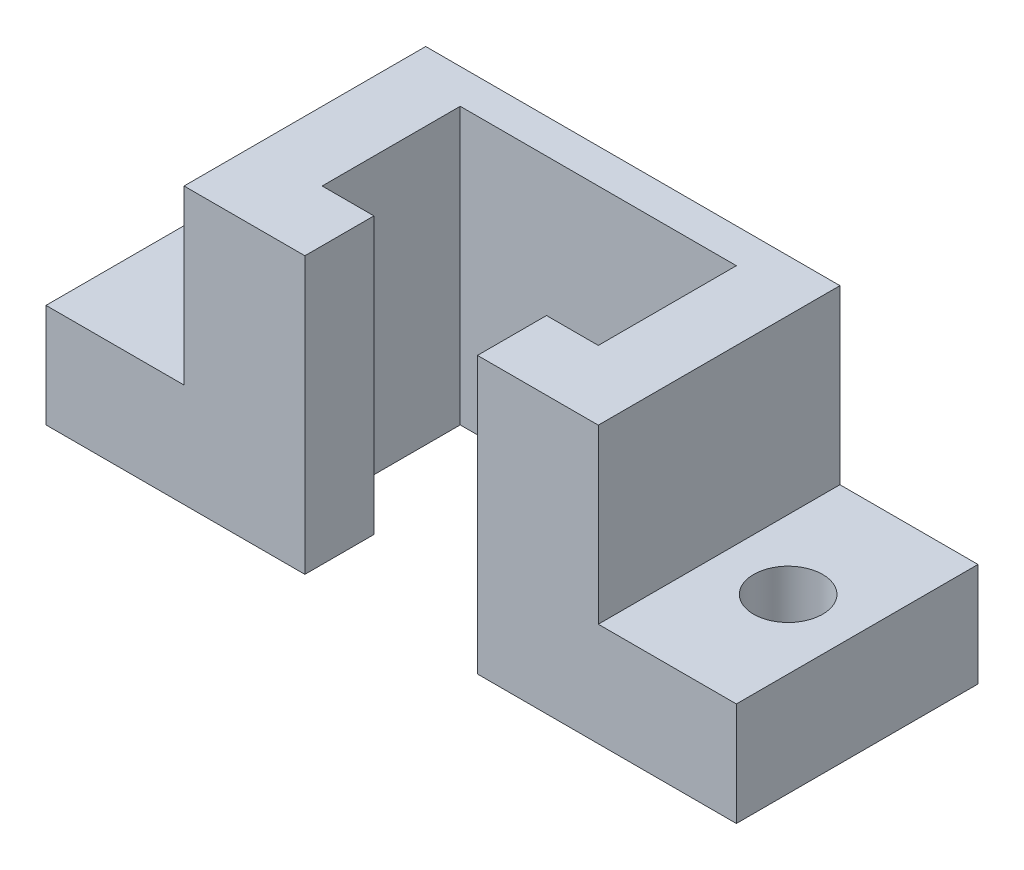
ISO-10303-21;
HEADER;
FILE_DESCRIPTION(('STEP AP214'),'2;1');
FILE_NAME('part.step','',(''),(''),'','','');
FILE_SCHEMA(('AUTOMOTIVE_DESIGN { 1 0 10303 214 1 1 1 1 }'));
ENDSEC;
DATA;
#1=APPLICATION_CONTEXT('core data for automotive mechanical design processes');
#2=APPLICATION_PROTOCOL_DEFINITION('international standard','automotive_design',2000,#1);
#3=PRODUCT_CONTEXT('',#1,'mechanical');
#4=PRODUCT('Part','Part','',(#3));
#5=PRODUCT_RELATED_PRODUCT_CATEGORY('part','',(#4));
#6=PRODUCT_DEFINITION_FORMATION('','',#4);
#7=PRODUCT_DEFINITION_CONTEXT('part definition',#1,'design');
#8=PRODUCT_DEFINITION('design','',#6,#7);
#9=PRODUCT_DEFINITION_SHAPE('','',#8);
#10=(LENGTH_UNIT() NAMED_UNIT(*) SI_UNIT(.MILLI.,.METRE.));
#11=(NAMED_UNIT(*) PLANE_ANGLE_UNIT() SI_UNIT($,.RADIAN.));
#12=(NAMED_UNIT(*) SI_UNIT($,.STERADIAN.) SOLID_ANGLE_UNIT());
#13=UNCERTAINTY_MEASURE_WITH_UNIT(LENGTH_MEASURE(1.E-05),#10,'distance_accuracy_value','');
#14=(GEOMETRIC_REPRESENTATION_CONTEXT(3) GLOBAL_UNCERTAINTY_ASSIGNED_CONTEXT((#13)) GLOBAL_UNIT_ASSIGNED_CONTEXT((#10,
#11,#12)) REPRESENTATION_CONTEXT('',''));
#15=CARTESIAN_POINT('',(0.,0.,0.));
#16=DIRECTION('',(0.,0.,1.));
#17=DIRECTION('',(1.,0.,0.));
#18=AXIS2_PLACEMENT_3D('',#15,#16,#17);
#19=CARTESIAN_POINT('',(0.,0.,35.));
#20=DIRECTION('',(0.,0.,-1.));
#21=DIRECTION('',(-1.,0.,0.));
#22=AXIS2_PLACEMENT_3D('',#19,#20,#21);
#23=PLANE('',#22);
#24=DIRECTION('',(0.,1.,0.));
#25=VECTOR('',#24,1.);
#26=CARTESIAN_POINT('',(30.,-20.,35.));
#27=LINE('',#26,#25);
#28=CARTESIAN_POINT('',(30.,-5.,35.));
#29=VERTEX_POINT('',#28);
#30=CARTESIAN_POINT('',(30.,19.9738533773121,35.));
#31=VERTEX_POINT('',#30);
#32=EDGE_CURVE('E168',#29,#31,#27,.T.);
#33=ORIENTED_EDGE('',*,*,#32,.T.);
#34=DIRECTION('',(1.,0.,0.));
#35=VECTOR('',#34,1.);
#36=CARTESIAN_POINT('',(30.,19.9738533773121,35.));
#37=LINE('',#36,#35);
#38=CARTESIAN_POINT('',(12.5,19.9738533773121,35.));
#39=VERTEX_POINT('',#38);
#40=EDGE_CURVE('E161',#39,#31,#37,.T.);
#41=ORIENTED_EDGE('',*,*,#40,.F.);
#42=DIRECTION('',(0.,1.,0.));
#43=VECTOR('',#42,1.);
#44=CARTESIAN_POINT('',(12.5,-60.,35.));
#45=LINE('',#44,#43);
#46=CARTESIAN_POINT('',(12.5,-20.,35.));
#47=VERTEX_POINT('',#46);
#48=EDGE_CURVE('E237',#47,#39,#45,.T.);
#49=ORIENTED_EDGE('',*,*,#48,.F.);
#50=DIRECTION('',(1.,0.,0.));
#51=VECTOR('',#50,1.);
#52=CARTESIAN_POINT('',(-30.,-20.,35.));
#53=LINE('',#52,#51);
#54=CARTESIAN_POINT('',(50.,-20.,35.));
#55=VERTEX_POINT('',#54);
#56=EDGE_CURVE('E167',#47,#55,#53,.T.);
#57=ORIENTED_EDGE('',*,*,#56,.T.);
#58=DIRECTION('',(0.,-1.,0.));
#59=VECTOR('',#58,1.);
#60=CARTESIAN_POINT('',(50.,-20.,35.));
#61=LINE('',#60,#59);
#62=CARTESIAN_POINT('',(50.,-5.,35.));
#63=VERTEX_POINT('',#62);
#64=EDGE_CURVE('E225',#63,#55,#61,.T.);
#65=ORIENTED_EDGE('',*,*,#64,.F.);
#66=DIRECTION('',(-1.,0.,0.));
#67=VECTOR('',#66,1.);
#68=CARTESIAN_POINT('',(50.,-5.,35.));
#69=LINE('',#68,#67);
#70=EDGE_CURVE('E234',#63,#29,#69,.T.);
#71=ORIENTED_EDGE('',*,*,#70,.T.);
#72=EDGE_LOOP('',(#33,#41,#49,#57,#65,#71));
#73=FACE_BOUND('',#72,.T.);
#74=ADVANCED_FACE('F36',(#73),#23,.F.);
#75=CARTESIAN_POINT('',(-30.,-20.,35.));
#76=DIRECTION('',(1.,0.,0.));
#77=DIRECTION('',(0.,0.,-1.));
#78=AXIS2_PLACEMENT_3D('',#75,#76,#77);
#79=PLANE('',#78);
#80=DIRECTION('',(0.,-1.,0.));
#81=VECTOR('',#80,1.);
#82=CARTESIAN_POINT('',(-30.,-20.,35.));
#83=LINE('',#82,#81);
#84=CARTESIAN_POINT('',(-30.,19.9738533773121,35.));
#85=VERTEX_POINT('',#84);
#86=CARTESIAN_POINT('',(-30.,-5.,35.));
#87=VERTEX_POINT('',#86);
#88=EDGE_CURVE('E40',#85,#87,#83,.T.);
#89=ORIENTED_EDGE('',*,*,#88,.F.);
#90=DIRECTION('',(0.,0.,1.));
#91=VECTOR('',#90,1.);
#92=CARTESIAN_POINT('',(-30.,19.9738533773121,-5.00000000014378E-05));
#93=LINE('',#92,#91);
#94=CARTESIAN_POINT('',(-30.,19.9738533773121,0.));
#95=VERTEX_POINT('',#94);
#96=EDGE_CURVE('E149',#95,#85,#93,.T.);
#97=ORIENTED_EDGE('',*,*,#96,.F.);
#98=DIRECTION('',(0.,-1.,0.));
#99=VECTOR('',#98,1.);
#100=CARTESIAN_POINT('',(-30.,-20.,0.));
#101=LINE('',#100,#99);
#102=CARTESIAN_POINT('',(-30.,-5.,0.));
#103=VERTEX_POINT('',#102);
#104=EDGE_CURVE('E177',#95,#103,#101,.T.);
#105=ORIENTED_EDGE('',*,*,#104,.T.);
#106=DIRECTION('',(0.,0.,-1.));
#107=VECTOR('',#106,1.);
#108=CARTESIAN_POINT('',(-30.,-5.,0.));
#109=LINE('',#108,#107);
#110=EDGE_CURVE('E165',#87,#103,#109,.T.);
#111=ORIENTED_EDGE('',*,*,#110,.F.);
#112=EDGE_LOOP('',(#89,#97,#105,#111));
#113=FACE_BOUND('',#112,.T.);
#114=ADVANCED_FACE('F163',(#113),#79,.F.);
#115=CARTESIAN_POINT('',(30.,-20.,35.));
#116=DIRECTION('',(-1.,0.,0.));
#117=DIRECTION('',(0.,0.,1.));
#118=AXIS2_PLACEMENT_3D('',#115,#116,#117);
#119=PLANE('',#118);
#120=DIRECTION('',(0.,1.,0.));
#121=VECTOR('',#120,1.);
#122=CARTESIAN_POINT('',(30.,-20.,0.));
#123=LINE('',#122,#121);
#124=CARTESIAN_POINT('',(30.,-5.,0.));
#125=VERTEX_POINT('',#124);
#126=CARTESIAN_POINT('',(30.,19.9738533773121,0.));
#127=VERTEX_POINT('',#126);
#128=EDGE_CURVE('E182',#125,#127,#123,.T.);
#129=ORIENTED_EDGE('',*,*,#128,.T.);
#130=DIRECTION('',(0.,0.,1.));
#131=VECTOR('',#130,1.);
#132=CARTESIAN_POINT('',(30.,19.9738533773121,-5.00000000014378E-05));
#133=LINE('',#132,#131);
#134=EDGE_CURVE('E155',#127,#31,#133,.T.);
#135=ORIENTED_EDGE('',*,*,#134,.T.);
#136=ORIENTED_EDGE('',*,*,#32,.F.);
#137=DIRECTION('',(0.,0.,1.));
#138=VECTOR('',#137,1.);
#139=CARTESIAN_POINT('',(30.,-5.,35.));
#140=LINE('',#139,#138);
#141=EDGE_CURVE('E185',#125,#29,#140,.T.);
#142=ORIENTED_EDGE('',*,*,#141,.F.);
#143=EDGE_LOOP('',(#129,#135,#136,#142));
#144=FACE_BOUND('',#143,.T.);
#145=ADVANCED_FACE('F38',(#144),#119,.F.);
#146=CARTESIAN_POINT('',(-20.,-60.,25.));
#147=DIRECTION('',(0.,0.,1.));
#148=DIRECTION('',(1.,0.,0.));
#149=AXIS2_PLACEMENT_3D('',#146,#147,#148);
#150=PLANE('',#149);
#151=DIRECTION('',(0.,1.,0.));
#152=VECTOR('',#151,1.);
#153=CARTESIAN_POINT('',(-20.,-60.,25.));
#154=LINE('',#153,#152);
#155=CARTESIAN_POINT('',(-20.,-20.,25.));
#156=VERTEX_POINT('',#155);
#157=CARTESIAN_POINT('',(-20.,19.9738533773121,25.));
#158=VERTEX_POINT('',#157);
#159=EDGE_CURVE('E251',#156,#158,#154,.T.);
#160=ORIENTED_EDGE('',*,*,#159,.T.);
#161=DIRECTION('',(1.,0.,0.));
#162=VECTOR('',#161,1.);
#163=CARTESIAN_POINT('',(-20.,19.9738533773121,25.));
#164=LINE('',#163,#162);
#165=CARTESIAN_POINT('',(-12.5,19.9738533773121,25.));
#166=VERTEX_POINT('',#165);
#167=EDGE_CURVE('E292',#158,#166,#164,.T.);
#168=ORIENTED_EDGE('',*,*,#167,.T.);
#169=DIRECTION('',(0.,-1.,0.));
#170=VECTOR('',#169,1.);
#171=CARTESIAN_POINT('',(-12.5,-60.,25.));
#172=LINE('',#171,#170);
#173=CARTESIAN_POINT('',(-12.5,-20.,25.));
#174=VERTEX_POINT('',#173);
#175=EDGE_CURVE('E46',#166,#174,#172,.T.);
#176=ORIENTED_EDGE('',*,*,#175,.T.);
#177=DIRECTION('',(1.,0.,0.));
#178=VECTOR('',#177,1.);
#179=CARTESIAN_POINT('',(-30.,-20.,25.));
#180=LINE('',#179,#178);
#181=EDGE_CURVE('E280',#156,#174,#180,.T.);
#182=ORIENTED_EDGE('',*,*,#181,.F.);
#183=EDGE_LOOP('',(#160,#168,#176,#182));
#184=FACE_BOUND('',#183,.T.);
#185=ADVANCED_FACE('F290',(#184),#150,.F.);
#186=CARTESIAN_POINT('',(-30.,-20.,35.));
#187=DIRECTION('',(0.,1.,0.));
#188=DIRECTION('',(0.,0.,1.));
#189=AXIS2_PLACEMENT_3D('',#186,#187,#188);
#190=PLANE('',#189);
#191=CARTESIAN_POINT('',(40.,-20.,17.5));
#192=DIRECTION('',(0.,-1.,0.));
#193=DIRECTION('',(0.,0.,-1.));
#194=AXIS2_PLACEMENT_3D('',#191,#192,#193);
#195=CIRCLE('',#194,5.);
#196=CARTESIAN_POINT('',(40.,-20.,12.5));
#197=VERTEX_POINT('',#196);
#198=EDGE_CURVE('E205',#197,#197,#195,.T.);
#199=ORIENTED_EDGE('',*,*,#198,.F.);
#200=EDGE_LOOP('',(#199));
#201=FACE_BOUND('',#200,.T.);
#202=CARTESIAN_POINT('',(-40.,-20.,17.5));
#203=DIRECTION('',(0.,-1.,0.));
#204=DIRECTION('',(0.,0.,-1.));
#205=AXIS2_PLACEMENT_3D('',#202,#203,#204);
#206=CIRCLE('',#205,5.);
#207=CARTESIAN_POINT('',(-40.,-20.,12.5));
#208=VERTEX_POINT('',#207);
#209=EDGE_CURVE('E310',#208,#208,#206,.T.);
#210=ORIENTED_EDGE('',*,*,#209,.F.);
#211=EDGE_LOOP('',(#210));
#212=FACE_BOUND('',#211,.T.);
#213=ORIENTED_EDGE('',*,*,#181,.T.);
#214=DIRECTION('',(0.,0.,1.));
#215=VECTOR('',#214,1.);
#216=CARTESIAN_POINT('',(-12.5,-20.,35.));
#217=LINE('',#216,#215);
#218=CARTESIAN_POINT('',(-12.5,-20.,35.));
#219=VERTEX_POINT('',#218);
#220=EDGE_CURVE('E245',#174,#219,#217,.T.);
#221=ORIENTED_EDGE('',*,*,#220,.T.);
#222=CARTESIAN_POINT('',(-50.,-20.,35.));
#223=VERTEX_POINT('',#222);
#224=EDGE_CURVE('E169',#223,#219,#53,.T.);
#225=ORIENTED_EDGE('',*,*,#224,.F.);
#226=DIRECTION('',(0.,0.,1.));
#227=VECTOR('',#226,1.);
#228=CARTESIAN_POINT('',(-50.,-20.,0.));
#229=LINE('',#228,#227);
#230=CARTESIAN_POINT('',(-50.,-20.,0.));
#231=VERTEX_POINT('',#230);
#232=EDGE_CURVE('E317',#231,#223,#229,.T.);
#233=ORIENTED_EDGE('',*,*,#232,.F.);
#234=DIRECTION('',(1.,0.,0.));
#235=VECTOR('',#234,1.);
#236=CARTESIAN_POINT('',(-30.,-20.,0.));
#237=LINE('',#236,#235);
#238=CARTESIAN_POINT('',(50.,-20.,0.));
#239=VERTEX_POINT('',#238);
#240=EDGE_CURVE('E172',#231,#239,#237,.T.);
#241=ORIENTED_EDGE('',*,*,#240,.T.);
#242=DIRECTION('',(0.,0.,-1.));
#243=VECTOR('',#242,1.);
#244=CARTESIAN_POINT('',(50.,-20.,35.));
#245=LINE('',#244,#243);
#246=EDGE_CURVE('E228',#55,#239,#245,.T.);
#247=ORIENTED_EDGE('',*,*,#246,.F.);
#248=ORIENTED_EDGE('',*,*,#56,.F.);
#249=DIRECTION('',(0.,0.,-1.));
#250=VECTOR('',#249,1.);
#251=CARTESIAN_POINT('',(12.5,-20.,35.));
#252=LINE('',#251,#250);
#253=CARTESIAN_POINT('',(12.5,-20.,25.));
#254=VERTEX_POINT('',#253);
#255=EDGE_CURVE('E240',#47,#254,#252,.T.);
#256=ORIENTED_EDGE('',*,*,#255,.T.);
#257=CARTESIAN_POINT('',(20.,-20.,25.));
#258=VERTEX_POINT('',#257);
#259=EDGE_CURVE('E278',#254,#258,#180,.T.);
#260=ORIENTED_EDGE('',*,*,#259,.T.);
#261=DIRECTION('',(0.,0.,-1.));
#262=VECTOR('',#261,1.);
#263=CARTESIAN_POINT('',(20.,-20.,35.));
#264=LINE('',#263,#262);
#265=CARTESIAN_POINT('',(20.,-20.,5.));
#266=VERTEX_POINT('',#265);
#267=EDGE_CURVE('E270',#258,#266,#264,.T.);
#268=ORIENTED_EDGE('',*,*,#267,.T.);
#269=DIRECTION('',(-1.,0.,0.));
#270=VECTOR('',#269,1.);
#271=CARTESIAN_POINT('',(-30.,-20.,5.));
#272=LINE('',#271,#270);
#273=CARTESIAN_POINT('',(-20.,-20.,5.));
#274=VERTEX_POINT('',#273);
#275=EDGE_CURVE('E193',#266,#274,#272,.T.);
#276=ORIENTED_EDGE('',*,*,#275,.T.);
#277=DIRECTION('',(0.,0.,1.));
#278=VECTOR('',#277,1.);
#279=CARTESIAN_POINT('',(-20.,-20.,35.));
#280=LINE('',#279,#278);
#281=EDGE_CURVE('E295',#274,#156,#280,.T.);
#282=ORIENTED_EDGE('',*,*,#281,.T.);
#283=EDGE_LOOP('',(#213,#221,#225,#233,#241,#247,#248,#256,#260,#268,#276,#282));
#284=FACE_BOUND('',#283,.T.);
#285=ADVANCED_FACE('F275',(#201,#212,#284),#190,.F.);
#286=DIRECTION('',(0.,1.,0.));
#287=VECTOR('',#286,1.);
#288=CARTESIAN_POINT('',(-12.5,-60.,35.));
#289=LINE('',#288,#287);
#290=CARTESIAN_POINT('',(-12.5,19.9738533773121,35.));
#291=VERTEX_POINT('',#290);
#292=EDGE_CURVE('E160',#219,#291,#289,.T.);
#293=ORIENTED_EDGE('',*,*,#292,.T.);
#294=EDGE_CURVE('E54',#85,#291,#37,.T.);
#295=ORIENTED_EDGE('',*,*,#294,.F.);
#296=ORIENTED_EDGE('',*,*,#88,.T.);
#297=DIRECTION('',(1.,0.,0.));
#298=VECTOR('',#297,1.);
#299=CARTESIAN_POINT('',(-50.,-5.,35.));
#300=LINE('',#299,#298);
#301=CARTESIAN_POINT('',(-50.,-5.,35.));
#302=VERTEX_POINT('',#301);
#303=EDGE_CURVE('E208',#302,#87,#300,.T.);
#304=ORIENTED_EDGE('',*,*,#303,.F.);
#305=DIRECTION('',(0.,1.,0.));
#306=VECTOR('',#305,1.);
#307=CARTESIAN_POINT('',(-50.,-20.,35.));
#308=LINE('',#307,#306);
#309=EDGE_CURVE('E319',#223,#302,#308,.T.);
#310=ORIENTED_EDGE('',*,*,#309,.F.);
#311=ORIENTED_EDGE('',*,*,#224,.T.);
#312=EDGE_LOOP('',(#293,#295,#296,#304,#310,#311));
#313=FACE_BOUND('',#312,.T.);
#314=ADVANCED_FACE('F158',(#313),#23,.F.);
#315=CARTESIAN_POINT('',(0.,0.,0.));
#316=DIRECTION('',(0.,0.,-1.));
#317=DIRECTION('',(-1.,0.,0.));
#318=AXIS2_PLACEMENT_3D('',#315,#316,#317);
#319=PLANE('',#318);
#320=DIRECTION('',(-1.,0.,0.));
#321=VECTOR('',#320,1.);
#322=CARTESIAN_POINT('',(0.,19.9738533773121,0.));
#323=LINE('',#322,#321);
#324=EDGE_CURVE('E152',#127,#95,#323,.T.);
#325=ORIENTED_EDGE('',*,*,#324,.F.);
#326=ORIENTED_EDGE('',*,*,#128,.F.);
#327=DIRECTION('',(-1.,0.,0.));
#328=VECTOR('',#327,1.);
#329=CARTESIAN_POINT('',(50.,-5.,0.));
#330=LINE('',#329,#328);
#331=CARTESIAN_POINT('',(50.,-5.,0.));
#332=VERTEX_POINT('',#331);
#333=EDGE_CURVE('E242',#332,#125,#330,.T.);
#334=ORIENTED_EDGE('',*,*,#333,.F.);
#335=DIRECTION('',(0.,1.,0.));
#336=VECTOR('',#335,1.);
#337=CARTESIAN_POINT('',(50.,-20.,0.));
#338=LINE('',#337,#336);
#339=EDGE_CURVE('E231',#239,#332,#338,.T.);
#340=ORIENTED_EDGE('',*,*,#339,.F.);
#341=ORIENTED_EDGE('',*,*,#240,.F.);
#342=DIRECTION('',(0.,-1.,0.));
#343=VECTOR('',#342,1.);
#344=CARTESIAN_POINT('',(-50.,-20.,0.));
#345=LINE('',#344,#343);
#346=CARTESIAN_POINT('',(-50.,-5.,0.));
#347=VERTEX_POINT('',#346);
#348=EDGE_CURVE('E218',#347,#231,#345,.T.);
#349=ORIENTED_EDGE('',*,*,#348,.F.);
#350=DIRECTION('',(1.,0.,0.));
#351=VECTOR('',#350,1.);
#352=CARTESIAN_POINT('',(-50.,-5.,0.));
#353=LINE('',#352,#351);
#354=EDGE_CURVE('E210',#347,#103,#353,.T.);
#355=ORIENTED_EDGE('',*,*,#354,.T.);
#356=ORIENTED_EDGE('',*,*,#104,.F.);
#357=EDGE_LOOP('',(#325,#326,#334,#340,#341,#349,#355,#356));
#358=FACE_BOUND('',#357,.T.);
#359=ADVANCED_FACE('F329',(#358),#319,.T.);
#360=CARTESIAN_POINT('',(20.,-60.,25.));
#361=DIRECTION('',(1.,0.,0.));
#362=DIRECTION('',(0.,0.,-1.));
#363=AXIS2_PLACEMENT_3D('',#360,#361,#362);
#364=PLANE('',#363);
#365=DIRECTION('',(0.,1.,0.));
#366=VECTOR('',#365,1.);
#367=CARTESIAN_POINT('',(20.,-60.,25.));
#368=LINE('',#367,#366);
#369=CARTESIAN_POINT('',(20.,19.9738533773121,25.));
#370=VERTEX_POINT('',#369);
#371=EDGE_CURVE('E248',#258,#370,#368,.T.);
#372=ORIENTED_EDGE('',*,*,#371,.T.);
#373=DIRECTION('',(0.,0.,-1.));
#374=VECTOR('',#373,1.);
#375=CARTESIAN_POINT('',(20.,19.9738533773121,25.));
#376=LINE('',#375,#374);
#377=CARTESIAN_POINT('',(20.,19.9738533773121,5.));
#378=VERTEX_POINT('',#377);
#379=EDGE_CURVE('E272',#370,#378,#376,.T.);
#380=ORIENTED_EDGE('',*,*,#379,.T.);
#381=DIRECTION('',(0.,1.,0.));
#382=VECTOR('',#381,1.);
#383=CARTESIAN_POINT('',(20.,-60.,5.));
#384=LINE('',#383,#382);
#385=EDGE_CURVE('E190',#266,#378,#384,.T.);
#386=ORIENTED_EDGE('',*,*,#385,.F.);
#387=ORIENTED_EDGE('',*,*,#267,.F.);
#388=EDGE_LOOP('',(#372,#380,#386,#387));
#389=FACE_BOUND('',#388,.T.);
#390=ADVANCED_FACE('F269',(#389),#364,.F.);
#391=DIRECTION('',(0.,1.,0.));
#392=VECTOR('',#391,1.);
#393=CARTESIAN_POINT('',(12.5,-60.,25.));
#394=LINE('',#393,#392);
#395=CARTESIAN_POINT('',(12.5,19.9738533773121,25.));
#396=VERTEX_POINT('',#395);
#397=EDGE_CURVE('E279',#254,#396,#394,.T.);
#398=ORIENTED_EDGE('',*,*,#397,.T.);
#399=DIRECTION('',(1.,0.,0.));
#400=VECTOR('',#399,1.);
#401=CARTESIAN_POINT('',(-20.,19.9738533773121,25.));
#402=LINE('',#401,#400);
#403=EDGE_CURVE('E303',#396,#370,#402,.T.);
#404=ORIENTED_EDGE('',*,*,#403,.T.);
#405=ORIENTED_EDGE('',*,*,#371,.F.);
#406=ORIENTED_EDGE('',*,*,#259,.F.);
#407=EDGE_LOOP('',(#398,#404,#405,#406));
#408=FACE_BOUND('',#407,.T.);
#409=ADVANCED_FACE('F343',(#408),#150,.F.);
#410=CARTESIAN_POINT('',(-20.,-60.,25.));
#411=DIRECTION('',(-1.,0.,0.));
#412=DIRECTION('',(0.,0.,1.));
#413=AXIS2_PLACEMENT_3D('',#410,#411,#412);
#414=PLANE('',#413);
#415=DIRECTION('',(0.,1.,0.));
#416=VECTOR('',#415,1.);
#417=CARTESIAN_POINT('',(-20.,-60.,5.));
#418=LINE('',#417,#416);
#419=CARTESIAN_POINT('',(-20.,19.9738533773121,5.));
#420=VERTEX_POINT('',#419);
#421=EDGE_CURVE('E253',#274,#420,#418,.T.);
#422=ORIENTED_EDGE('',*,*,#421,.T.);
#423=DIRECTION('',(0.,0.,1.));
#424=VECTOR('',#423,1.);
#425=CARTESIAN_POINT('',(-20.,19.9738533773121,25.));
#426=LINE('',#425,#424);
#427=EDGE_CURVE('E297',#420,#158,#426,.T.);
#428=ORIENTED_EDGE('',*,*,#427,.T.);
#429=ORIENTED_EDGE('',*,*,#159,.F.);
#430=ORIENTED_EDGE('',*,*,#281,.F.);
#431=EDGE_LOOP('',(#422,#428,#429,#430));
#432=FACE_BOUND('',#431,.T.);
#433=ADVANCED_FACE('F296',(#432),#414,.F.);
#434=CARTESIAN_POINT('',(-20.,-60.,5.));
#435=DIRECTION('',(0.,0.,-1.));
#436=DIRECTION('',(-1.,0.,0.));
#437=AXIS2_PLACEMENT_3D('',#434,#435,#436);
#438=PLANE('',#437);
#439=ORIENTED_EDGE('',*,*,#385,.T.);
#440=DIRECTION('',(-1.,0.,0.));
#441=VECTOR('',#440,1.);
#442=CARTESIAN_POINT('',(-20.,19.9738533773121,5.));
#443=LINE('',#442,#441);
#444=EDGE_CURVE('E263',#378,#420,#443,.T.);
#445=ORIENTED_EDGE('',*,*,#444,.T.);
#446=ORIENTED_EDGE('',*,*,#421,.F.);
#447=ORIENTED_EDGE('',*,*,#275,.F.);
#448=EDGE_LOOP('',(#439,#445,#446,#447));
#449=FACE_BOUND('',#448,.T.);
#450=ADVANCED_FACE('F262',(#449),#438,.F.);
#451=CARTESIAN_POINT('',(12.5,-60.,35.));
#452=DIRECTION('',(1.,0.,0.));
#453=DIRECTION('',(0.,0.,-1.));
#454=AXIS2_PLACEMENT_3D('',#451,#452,#453);
#455=PLANE('',#454);
#456=ORIENTED_EDGE('',*,*,#48,.T.);
#457=DIRECTION('',(0.,0.,-1.));
#458=VECTOR('',#457,1.);
#459=CARTESIAN_POINT('',(12.5,19.9738533773121,35.));
#460=LINE('',#459,#458);
#461=EDGE_CURVE('E306',#39,#396,#460,.T.);
#462=ORIENTED_EDGE('',*,*,#461,.T.);
#463=ORIENTED_EDGE('',*,*,#397,.F.);
#464=ORIENTED_EDGE('',*,*,#255,.F.);
#465=EDGE_LOOP('',(#456,#462,#463,#464));
#466=FACE_BOUND('',#465,.T.);
#467=ADVANCED_FACE('F344',(#466),#455,.F.);
#468=CARTESIAN_POINT('',(-12.5,-60.,35.));
#469=DIRECTION('',(-1.,0.,0.));
#470=DIRECTION('',(0.,0.,1.));
#471=AXIS2_PLACEMENT_3D('',#468,#469,#470);
#472=PLANE('',#471);
#473=ORIENTED_EDGE('',*,*,#175,.F.);
#474=DIRECTION('',(0.,0.,1.));
#475=VECTOR('',#474,1.);
#476=CARTESIAN_POINT('',(-12.5,19.9738533773121,35.));
#477=LINE('',#476,#475);
#478=EDGE_CURVE('E11',#166,#291,#477,.T.);
#479=ORIENTED_EDGE('',*,*,#478,.T.);
#480=ORIENTED_EDGE('',*,*,#292,.F.);
#481=ORIENTED_EDGE('',*,*,#220,.F.);
#482=EDGE_LOOP('',(#473,#479,#480,#481));
#483=FACE_BOUND('',#482,.T.);
#484=ADVANCED_FACE('F294',(#483),#472,.F.);
#485=CARTESIAN_POINT('',(50.,-5.,35.));
#486=DIRECTION('',(0.,-1.,0.));
#487=DIRECTION('',(0.,0.,-1.));
#488=AXIS2_PLACEMENT_3D('',#485,#486,#487);
#489=PLANE('',#488);
#490=CARTESIAN_POINT('',(40.,-5.,17.5));
#491=DIRECTION('',(0.,-1.,0.));
#492=DIRECTION('',(0.,0.,-1.));
#493=AXIS2_PLACEMENT_3D('',#490,#491,#492);
#494=CIRCLE('',#493,5.);
#495=CARTESIAN_POINT('',(40.,-5.,12.5));
#496=VERTEX_POINT('',#495);
#497=EDGE_CURVE('E199',#496,#496,#494,.T.);
#498=ORIENTED_EDGE('',*,*,#497,.T.);
#499=EDGE_LOOP('',(#498));
#500=FACE_BOUND('',#499,.T.);
#501=ORIENTED_EDGE('',*,*,#141,.T.);
#502=ORIENTED_EDGE('',*,*,#70,.F.);
#503=DIRECTION('',(0.,0.,1.));
#504=VECTOR('',#503,1.);
#505=CARTESIAN_POINT('',(50.,-5.,35.));
#506=LINE('',#505,#504);
#507=EDGE_CURVE('E233',#332,#63,#506,.T.);
#508=ORIENTED_EDGE('',*,*,#507,.F.);
#509=ORIENTED_EDGE('',*,*,#333,.T.);
#510=EDGE_LOOP('',(#501,#502,#508,#509));
#511=FACE_BOUND('',#510,.T.);
#512=ADVANCED_FACE('F351',(#500,#511),#489,.F.);
#513=CARTESIAN_POINT('',(50.,0.,0.));
#514=DIRECTION('',(-1.,0.,0.));
#515=DIRECTION('',(0.,0.,1.));
#516=AXIS2_PLACEMENT_3D('',#513,#514,#515);
#517=PLANE('',#516);
#518=ORIENTED_EDGE('',*,*,#64,.T.);
#519=ORIENTED_EDGE('',*,*,#246,.T.);
#520=ORIENTED_EDGE('',*,*,#339,.T.);
#521=ORIENTED_EDGE('',*,*,#507,.T.);
#522=EDGE_LOOP('',(#518,#519,#520,#521));
#523=FACE_BOUND('',#522,.T.);
#524=ADVANCED_FACE('F336',(#523),#517,.F.);
#525=CARTESIAN_POINT('',(-50.,-5.,0.));
#526=DIRECTION('',(0.,-1.,0.));
#527=DIRECTION('',(0.,0.,-1.));
#528=AXIS2_PLACEMENT_3D('',#525,#526,#527);
#529=PLANE('',#528);
#530=CARTESIAN_POINT('',(-40.,-5.,17.5));
#531=DIRECTION('',(0.,-1.,0.));
#532=DIRECTION('',(0.,0.,-1.));
#533=AXIS2_PLACEMENT_3D('',#530,#531,#532);
#534=CIRCLE('',#533,5.);
#535=CARTESIAN_POINT('',(-40.,-5.,12.5));
#536=VERTEX_POINT('',#535);
#537=EDGE_CURVE('E202',#536,#536,#534,.T.);
#538=ORIENTED_EDGE('',*,*,#537,.T.);
#539=EDGE_LOOP('',(#538));
#540=FACE_BOUND('',#539,.T.);
#541=ORIENTED_EDGE('',*,*,#110,.T.);
#542=ORIENTED_EDGE('',*,*,#354,.F.);
#543=DIRECTION('',(0.,0.,-1.));
#544=VECTOR('',#543,1.);
#545=CARTESIAN_POINT('',(-50.,-5.,0.));
#546=LINE('',#545,#544);
#547=EDGE_CURVE('E215',#302,#347,#546,.T.);
#548=ORIENTED_EDGE('',*,*,#547,.F.);
#549=ORIENTED_EDGE('',*,*,#303,.T.);
#550=EDGE_LOOP('',(#541,#542,#548,#549));
#551=FACE_BOUND('',#550,.T.);
#552=ADVANCED_FACE('F327',(#540,#551),#529,.F.);
#553=CARTESIAN_POINT('',(-50.,0.,0.));
#554=DIRECTION('',(1.,0.,0.));
#555=DIRECTION('',(0.,0.,-1.));
#556=AXIS2_PLACEMENT_3D('',#553,#554,#555);
#557=PLANE('',#556);
#558=ORIENTED_EDGE('',*,*,#348,.T.);
#559=ORIENTED_EDGE('',*,*,#232,.T.);
#560=ORIENTED_EDGE('',*,*,#309,.T.);
#561=ORIENTED_EDGE('',*,*,#547,.T.);
#562=EDGE_LOOP('',(#558,#559,#560,#561));
#563=FACE_BOUND('',#562,.T.);
#564=ADVANCED_FACE('F324',(#563),#557,.F.);
#565=CARTESIAN_POINT('',(-40.,30.000025,17.5));
#566=DIRECTION('',(0.,-1.,0.));
#567=DIRECTION('',(0.,0.,-1.));
#568=AXIS2_PLACEMENT_3D('',#565,#566,#567);
#569=CYLINDRICAL_SURFACE('',#568,5.);
#570=ORIENTED_EDGE('',*,*,#209,.T.);
#571=EDGE_LOOP('',(#570));
#572=FACE_BOUND('',#571,.T.);
#573=ORIENTED_EDGE('',*,*,#537,.F.);
#574=EDGE_LOOP('',(#573));
#575=FACE_BOUND('',#574,.T.);
#576=ADVANCED_FACE('F377',(#572,#575),#569,.F.);
#577=CARTESIAN_POINT('',(40.,30.000025,17.5));
#578=DIRECTION('',(0.,-1.,0.));
#579=DIRECTION('',(0.,0.,-1.));
#580=AXIS2_PLACEMENT_3D('',#577,#578,#579);
#581=CYLINDRICAL_SURFACE('',#580,5.);
#582=ORIENTED_EDGE('',*,*,#198,.T.);
#583=EDGE_LOOP('',(#582));
#584=FACE_BOUND('',#583,.T.);
#585=ORIENTED_EDGE('',*,*,#497,.F.);
#586=EDGE_LOOP('',(#585));
#587=FACE_BOUND('',#586,.T.);
#588=ADVANCED_FACE('F380',(#584,#587),#581,.F.);
#589=CARTESIAN_POINT('',(30.,19.9738533773121,-5.00000000014378E-05));
#590=DIRECTION('',(0.,-1.,0.));
#591=DIRECTION('',(0.,0.,-1.));
#592=AXIS2_PLACEMENT_3D('',#589,#590,#591);
#593=PLANE('',#592);
#594=ORIENTED_EDGE('',*,*,#324,.T.);
#595=ORIENTED_EDGE('',*,*,#96,.T.);
#596=ORIENTED_EDGE('',*,*,#294,.T.);
#597=ORIENTED_EDGE('',*,*,#478,.F.);
#598=ORIENTED_EDGE('',*,*,#167,.F.);
#599=ORIENTED_EDGE('',*,*,#427,.F.);
#600=ORIENTED_EDGE('',*,*,#444,.F.);
#601=ORIENTED_EDGE('',*,*,#379,.F.);
#602=ORIENTED_EDGE('',*,*,#403,.F.);
#603=ORIENTED_EDGE('',*,*,#461,.F.);
#604=ORIENTED_EDGE('',*,*,#40,.T.);
#605=ORIENTED_EDGE('',*,*,#134,.F.);
#606=EDGE_LOOP('',(#594,#595,#596,#597,#598,#599,#600,#601,#602,#603,#604,#605));
#607=FACE_BOUND('',#606,.T.);
#608=ADVANCED_FACE('F150',(#607),#593,.F.);
#609=CLOSED_SHELL('',(#74,#114,#145,#185,#285,#314,#359,#390,#409,#433,#450,#467,#484,#512,#524,
#552,#564,#576,#588,#608));
#610=MANIFOLD_SOLID_BREP('B2',#609);
#611=ADVANCED_BREP_SHAPE_REPRESENTATION('',(#18,#610),#14);
#612=SHAPE_DEFINITION_REPRESENTATION(#9,#611);
ENDSEC;
END-ISO-10303-21;
